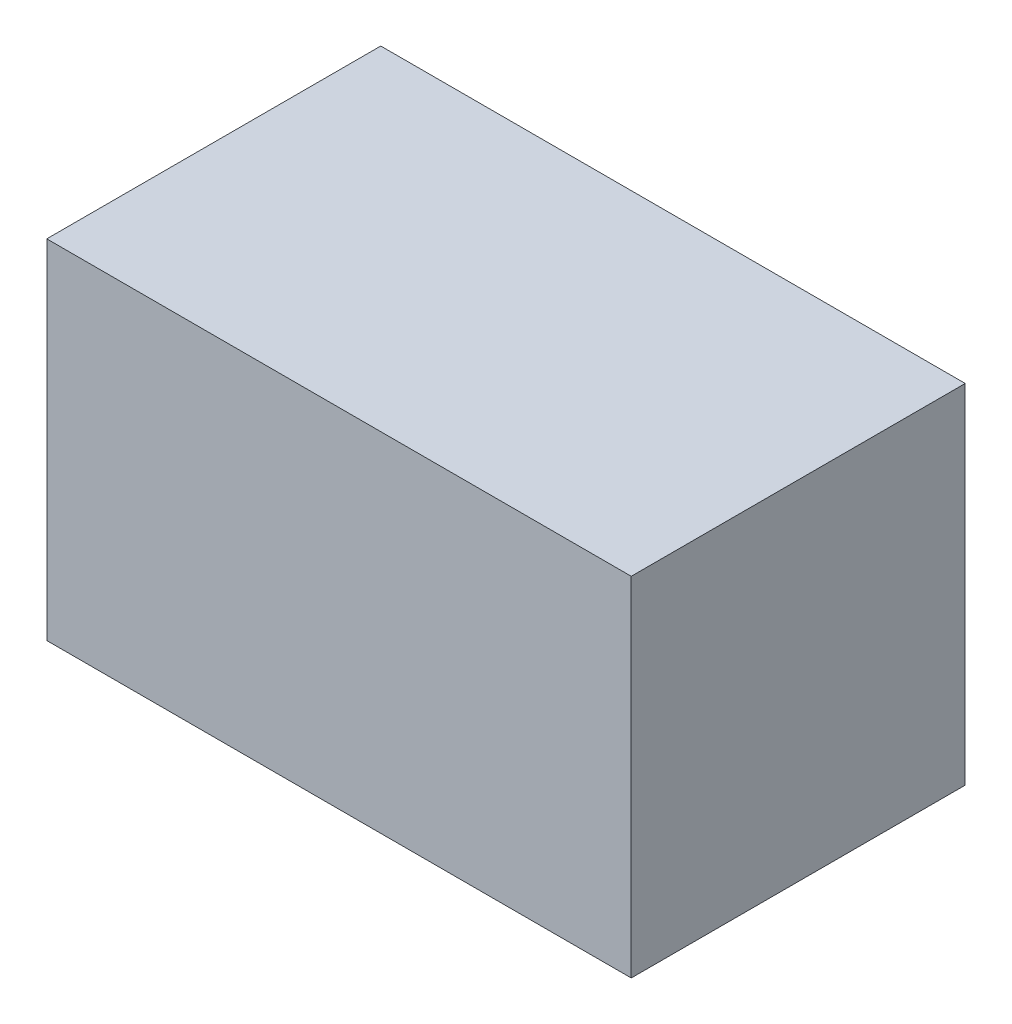
ISO-10303-21;
HEADER;
FILE_DESCRIPTION(('STEP AP214'),'2;1');
FILE_NAME('part.step','',(''),(''),'','','');
FILE_SCHEMA(('AUTOMOTIVE_DESIGN { 1 0 10303 214 1 1 1 1 }'));
ENDSEC;
DATA;
#1=APPLICATION_CONTEXT('core data for automotive mechanical design processes');
#2=APPLICATION_PROTOCOL_DEFINITION('international standard','automotive_design',2000,#1);
#3=PRODUCT_CONTEXT('',#1,'mechanical');
#4=PRODUCT('Part','Part','',(#3));
#5=PRODUCT_RELATED_PRODUCT_CATEGORY('part','',(#4));
#6=PRODUCT_DEFINITION_FORMATION('','',#4);
#7=PRODUCT_DEFINITION_CONTEXT('part definition',#1,'design');
#8=PRODUCT_DEFINITION('design','',#6,#7);
#9=PRODUCT_DEFINITION_SHAPE('','',#8);
#10=(LENGTH_UNIT() NAMED_UNIT(*) SI_UNIT(.MILLI.,.METRE.));
#11=(NAMED_UNIT(*) PLANE_ANGLE_UNIT() SI_UNIT($,.RADIAN.));
#12=(NAMED_UNIT(*) SI_UNIT($,.STERADIAN.) SOLID_ANGLE_UNIT());
#13=UNCERTAINTY_MEASURE_WITH_UNIT(LENGTH_MEASURE(1.E-05),#10,'distance_accuracy_value','');
#14=(GEOMETRIC_REPRESENTATION_CONTEXT(3) GLOBAL_UNCERTAINTY_ASSIGNED_CONTEXT((#13)) GLOBAL_UNIT_ASSIGNED_CONTEXT((#10,
#11,#12)) REPRESENTATION_CONTEXT('',''));
#15=CARTESIAN_POINT('',(0.,0.,0.));
#16=DIRECTION('',(0.,0.,1.));
#17=DIRECTION('',(1.,0.,0.));
#18=AXIS2_PLACEMENT_3D('',#15,#16,#17);
#19=CARTESIAN_POINT('',(0.,50.,0.));
#20=DIRECTION('',(1.,0.,0.));
#21=DIRECTION('',(0.,0.,-1.));
#22=AXIS2_PLACEMENT_3D('',#19,#20,#21);
#23=PLANE('',#22);
#24=DIRECTION('',(0.,0.,1.));
#25=VECTOR('',#24,1.);
#26=CARTESIAN_POINT('',(0.,0.,0.));
#27=LINE('',#26,#25);
#28=CARTESIAN_POINT('',(0.,0.,-48.));
#29=VERTEX_POINT('',#28);
#30=CARTESIAN_POINT('',(0.,0.,0.));
#31=VERTEX_POINT('',#30);
#32=EDGE_CURVE('E101',#29,#31,#27,.T.);
#33=ORIENTED_EDGE('',*,*,#32,.T.);
#34=DIRECTION('',(0.,-1.,0.));
#35=VECTOR('',#34,1.);
#36=CARTESIAN_POINT('',(0.,50.,0.));
#37=LINE('',#36,#35);
#38=CARTESIAN_POINT('',(0.,50.,0.));
#39=VERTEX_POINT('',#38);
#40=EDGE_CURVE('E11',#39,#31,#37,.T.);
#41=ORIENTED_EDGE('',*,*,#40,.F.);
#42=DIRECTION('',(0.,0.,1.));
#43=VECTOR('',#42,1.);
#44=CARTESIAN_POINT('',(0.,50.,0.));
#45=LINE('',#44,#43);
#46=CARTESIAN_POINT('',(0.,50.,-48.));
#47=VERTEX_POINT('',#46);
#48=EDGE_CURVE('E89',#47,#39,#45,.T.);
#49=ORIENTED_EDGE('',*,*,#48,.F.);
#50=DIRECTION('',(0.,-1.,0.));
#51=VECTOR('',#50,1.);
#52=CARTESIAN_POINT('',(0.,50.,-48.));
#53=LINE('',#52,#51);
#54=EDGE_CURVE('E97',#47,#29,#53,.T.);
#55=ORIENTED_EDGE('',*,*,#54,.T.);
#56=EDGE_LOOP('',(#33,#41,#49,#55));
#57=FACE_BOUND('',#56,.T.);
#58=ADVANCED_FACE('F38',(#57),#23,.F.);
#59=CARTESIAN_POINT('',(0.,50.,0.));
#60=DIRECTION('',(0.,0.,-1.));
#61=DIRECTION('',(-1.,0.,0.));
#62=AXIS2_PLACEMENT_3D('',#59,#60,#61);
#63=PLANE('',#62);
#64=DIRECTION('',(1.,0.,0.));
#65=VECTOR('',#64,1.);
#66=CARTESIAN_POINT('',(0.,0.,0.));
#67=LINE('',#66,#65);
#68=CARTESIAN_POINT('',(84.,0.,0.));
#69=VERTEX_POINT('',#68);
#70=EDGE_CURVE('E93',#31,#69,#67,.T.);
#71=ORIENTED_EDGE('',*,*,#70,.T.);
#72=DIRECTION('',(0.,-1.,0.));
#73=VECTOR('',#72,1.);
#74=CARTESIAN_POINT('',(84.,50.,0.));
#75=LINE('',#74,#73);
#76=CARTESIAN_POINT('',(84.,50.,0.));
#77=VERTEX_POINT('',#76);
#78=EDGE_CURVE('E46',#77,#69,#75,.T.);
#79=ORIENTED_EDGE('',*,*,#78,.F.);
#80=DIRECTION('',(1.,0.,0.));
#81=VECTOR('',#80,1.);
#82=CARTESIAN_POINT('',(0.,50.,0.));
#83=LINE('',#82,#81);
#84=EDGE_CURVE('E84',#39,#77,#83,.T.);
#85=ORIENTED_EDGE('',*,*,#84,.F.);
#86=ORIENTED_EDGE('',*,*,#40,.T.);
#87=EDGE_LOOP('',(#71,#79,#85,#86));
#88=FACE_BOUND('',#87,.T.);
#89=ADVANCED_FACE('F92',(#88),#63,.F.);
#90=CARTESIAN_POINT('',(84.,50.,0.));
#91=DIRECTION('',(-1.,0.,0.));
#92=DIRECTION('',(0.,0.,1.));
#93=AXIS2_PLACEMENT_3D('',#90,#91,#92);
#94=PLANE('',#93);
#95=DIRECTION('',(0.,0.,-1.));
#96=VECTOR('',#95,1.);
#97=CARTESIAN_POINT('',(84.,0.,0.));
#98=LINE('',#97,#96);
#99=CARTESIAN_POINT('',(84.,0.,-48.));
#100=VERTEX_POINT('',#99);
#101=EDGE_CURVE('E71',#69,#100,#98,.T.);
#102=ORIENTED_EDGE('',*,*,#101,.T.);
#103=DIRECTION('',(0.,-1.,0.));
#104=VECTOR('',#103,1.);
#105=CARTESIAN_POINT('',(84.,50.,-48.));
#106=LINE('',#105,#104);
#107=CARTESIAN_POINT('',(84.,50.,-48.));
#108=VERTEX_POINT('',#107);
#109=EDGE_CURVE('E94',#108,#100,#106,.T.);
#110=ORIENTED_EDGE('',*,*,#109,.F.);
#111=DIRECTION('',(0.,0.,-1.));
#112=VECTOR('',#111,1.);
#113=CARTESIAN_POINT('',(84.,50.,0.));
#114=LINE('',#113,#112);
#115=EDGE_CURVE('E87',#77,#108,#114,.T.);
#116=ORIENTED_EDGE('',*,*,#115,.F.);
#117=ORIENTED_EDGE('',*,*,#78,.T.);
#118=EDGE_LOOP('',(#102,#110,#116,#117));
#119=FACE_BOUND('',#118,.T.);
#120=ADVANCED_FACE('F95',(#119),#94,.F.);
#121=CARTESIAN_POINT('',(0.,50.,-48.));
#122=DIRECTION('',(0.,0.,1.));
#123=DIRECTION('',(1.,0.,0.));
#124=AXIS2_PLACEMENT_3D('',#121,#122,#123);
#125=PLANE('',#124);
#126=DIRECTION('',(-1.,0.,0.));
#127=VECTOR('',#126,1.);
#128=CARTESIAN_POINT('',(0.,0.,-48.));
#129=LINE('',#128,#127);
#130=EDGE_CURVE('E77',#100,#29,#129,.T.);
#131=ORIENTED_EDGE('',*,*,#130,.T.);
#132=ORIENTED_EDGE('',*,*,#54,.F.);
#133=DIRECTION('',(-1.,0.,0.));
#134=VECTOR('',#133,1.);
#135=CARTESIAN_POINT('',(0.,50.,-48.));
#136=LINE('',#135,#134);
#137=EDGE_CURVE('E54',#108,#47,#136,.T.);
#138=ORIENTED_EDGE('',*,*,#137,.F.);
#139=ORIENTED_EDGE('',*,*,#109,.T.);
#140=EDGE_LOOP('',(#131,#132,#138,#139));
#141=FACE_BOUND('',#140,.T.);
#142=ADVANCED_FACE('F108',(#141),#125,.F.);
#143=CARTESIAN_POINT('',(0.,50.,0.));
#144=DIRECTION('',(0.,-1.,0.));
#145=DIRECTION('',(0.,0.,-1.));
#146=AXIS2_PLACEMENT_3D('',#143,#144,#145);
#147=PLANE('',#146);
#148=ORIENTED_EDGE('',*,*,#48,.T.);
#149=ORIENTED_EDGE('',*,*,#84,.T.);
#150=ORIENTED_EDGE('',*,*,#115,.T.);
#151=ORIENTED_EDGE('',*,*,#137,.T.);
#152=EDGE_LOOP('',(#148,#149,#150,#151));
#153=FACE_BOUND('',#152,.T.);
#154=ADVANCED_FACE('F85',(#153),#147,.F.);
#155=CARTESIAN_POINT('',(0.,0.,0.));
#156=DIRECTION('',(0.,-1.,0.));
#157=DIRECTION('',(0.,0.,-1.));
#158=AXIS2_PLACEMENT_3D('',#155,#156,#157);
#159=PLANE('',#158);
#160=ORIENTED_EDGE('',*,*,#32,.F.);
#161=ORIENTED_EDGE('',*,*,#130,.F.);
#162=ORIENTED_EDGE('',*,*,#101,.F.);
#163=ORIENTED_EDGE('',*,*,#70,.F.);
#164=EDGE_LOOP('',(#160,#161,#162,#163));
#165=FACE_BOUND('',#164,.T.);
#166=ADVANCED_FACE('F111',(#165),#159,.T.);
#167=CLOSED_SHELL('',(#58,#89,#120,#142,#154,#166));
#168=MANIFOLD_SOLID_BREP('B2',#167);
#169=ADVANCED_BREP_SHAPE_REPRESENTATION('',(#18,#168),#14);
#170=SHAPE_DEFINITION_REPRESENTATION(#9,#169);
ENDSEC;
END-ISO-10303-21;
